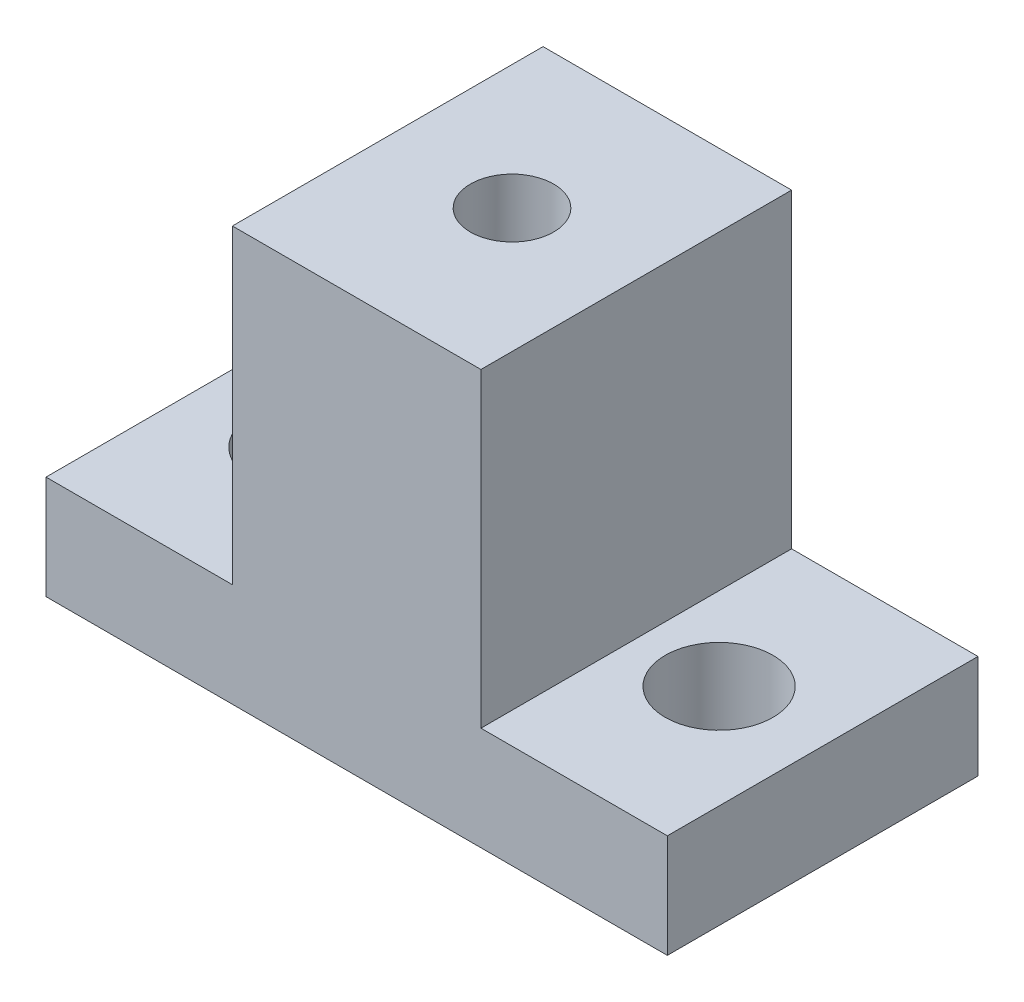
ISO-10303-21;
HEADER;
FILE_DESCRIPTION(('STEP AP214'),'2;1');
FILE_NAME('part.step','',(''),(''),'','','');
FILE_SCHEMA(('AUTOMOTIVE_DESIGN { 1 0 10303 214 1 1 1 1 }'));
ENDSEC;
DATA;
#1=APPLICATION_CONTEXT('core data for automotive mechanical design processes');
#2=APPLICATION_PROTOCOL_DEFINITION('international standard','automotive_design',2000,#1);
#3=PRODUCT_CONTEXT('',#1,'mechanical');
#4=PRODUCT('Part','Part','',(#3));
#5=PRODUCT_RELATED_PRODUCT_CATEGORY('part','',(#4));
#6=PRODUCT_DEFINITION_FORMATION('','',#4);
#7=PRODUCT_DEFINITION_CONTEXT('part definition',#1,'design');
#8=PRODUCT_DEFINITION('design','',#6,#7);
#9=PRODUCT_DEFINITION_SHAPE('','',#8);
#10=(LENGTH_UNIT() NAMED_UNIT(*) SI_UNIT(.MILLI.,.METRE.));
#11=(NAMED_UNIT(*) PLANE_ANGLE_UNIT() SI_UNIT($,.RADIAN.));
#12=(NAMED_UNIT(*) SI_UNIT($,.STERADIAN.) SOLID_ANGLE_UNIT());
#13=UNCERTAINTY_MEASURE_WITH_UNIT(LENGTH_MEASURE(1.E-05),#10,'distance_accuracy_value','');
#14=(GEOMETRIC_REPRESENTATION_CONTEXT(3) GLOBAL_UNCERTAINTY_ASSIGNED_CONTEXT((#13)) GLOBAL_UNIT_ASSIGNED_CONTEXT((#10,
#11,#12)) REPRESENTATION_CONTEXT('',''));
#15=CARTESIAN_POINT('',(0.,0.,0.));
#16=DIRECTION('',(0.,0.,1.));
#17=DIRECTION('',(1.,0.,0.));
#18=AXIS2_PLACEMENT_3D('',#15,#16,#17);
#19=CARTESIAN_POINT('',(0.,-12.7,0.));
#20=DIRECTION('',(0.,1.,0.));
#21=DIRECTION('',(0.,0.,1.));
#22=AXIS2_PLACEMENT_3D('',#19,#20,#21);
#23=PLANE('',#22);
#24=CARTESIAN_POINT('',(0.,-12.7,0.));
#25=DIRECTION('',(0.,-1.,0.));
#26=DIRECTION('',(0.,0.,-1.));
#27=AXIS2_PLACEMENT_3D('',#24,#25,#26);
#28=CIRCLE('',#27,6.35);
#29=CARTESIAN_POINT('',(0.,-12.7,-6.35));
#30=VERTEX_POINT('',#29);
#31=EDGE_CURVE('E328',#30,#30,#28,.T.);
#32=ORIENTED_EDGE('',*,*,#31,.F.);
#33=EDGE_LOOP('',(#32));
#34=FACE_BOUND('',#33,.T.);
#35=DIRECTION('',(0.,0.,1.));
#36=VECTOR('',#35,1.);
#37=CARTESIAN_POINT('',(-19.05,-12.7,-9.525));
#38=LINE('',#37,#36);
#39=CARTESIAN_POINT('',(-19.05,-12.7,-9.525));
#40=VERTEX_POINT('',#39);
#41=CARTESIAN_POINT('',(-19.05,-12.7,9.525));
#42=VERTEX_POINT('',#41);
#43=EDGE_CURVE('E149',#40,#42,#38,.T.);
#44=ORIENTED_EDGE('',*,*,#43,.F.);
#45=DIRECTION('',(-1.,0.,0.));
#46=VECTOR('',#45,1.);
#47=CARTESIAN_POINT('',(-19.05,-12.7,-9.525));
#48=LINE('',#47,#46);
#49=CARTESIAN_POINT('',(19.05,-12.7,-9.525));
#50=VERTEX_POINT('',#49);
#51=EDGE_CURVE('E156',#50,#40,#48,.T.);
#52=ORIENTED_EDGE('',*,*,#51,.F.);
#53=DIRECTION('',(0.,0.,-1.));
#54=VECTOR('',#53,1.);
#55=CARTESIAN_POINT('',(19.05,-12.7,-9.525));
#56=LINE('',#55,#54);
#57=CARTESIAN_POINT('',(19.05,-12.7,9.525));
#58=VERTEX_POINT('',#57);
#59=EDGE_CURVE('E164',#58,#50,#56,.T.);
#60=ORIENTED_EDGE('',*,*,#59,.F.);
#61=DIRECTION('',(1.,0.,0.));
#62=VECTOR('',#61,1.);
#63=CARTESIAN_POINT('',(-19.05,-12.7,9.525));
#64=LINE('',#63,#62);
#65=EDGE_CURVE('E161',#42,#58,#64,.T.);
#66=ORIENTED_EDGE('',*,*,#65,.F.);
#67=EDGE_LOOP('',(#44,#52,#60,#66));
#68=FACE_BOUND('',#67,.T.);
#69=CARTESIAN_POINT('',(-12.7,-12.7,0.));
#70=DIRECTION('',(0.,1.,0.));
#71=DIRECTION('',(0.,0.,1.));
#72=AXIS2_PLACEMENT_3D('',#69,#70,#71);
#73=CIRCLE('',#72,3.302);
#74=CARTESIAN_POINT('',(-12.7,-12.7,3.302));
#75=VERTEX_POINT('',#74);
#76=EDGE_CURVE('E132',#75,#75,#73,.T.);
#77=ORIENTED_EDGE('',*,*,#76,.T.);
#78=EDGE_LOOP('',(#77));
#79=FACE_BOUND('',#78,.T.);
#80=CARTESIAN_POINT('',(12.7,-12.7,0.));
#81=DIRECTION('',(0.,-1.,0.));
#82=DIRECTION('',(0.,0.,1.));
#83=AXIS2_PLACEMENT_3D('',#80,#81,#82);
#84=CIRCLE('',#83,3.302);
#85=CARTESIAN_POINT('',(12.7,-12.7,3.302));
#86=VERTEX_POINT('',#85);
#87=EDGE_CURVE('E127',#86,#86,#84,.T.);
#88=ORIENTED_EDGE('',*,*,#87,.F.);
#89=EDGE_LOOP('',(#88));
#90=FACE_BOUND('',#89,.T.);
#91=ADVANCED_FACE('F34',(#34,#68,#79,#90),#23,.F.);
#92=CARTESIAN_POINT('',(19.05,-6.35,-9.525));
#93=DIRECTION('',(0.,1.,0.));
#94=DIRECTION('',(-1.,0.,0.));
#95=AXIS2_PLACEMENT_3D('',#92,#93,#94);
#96=PLANE('',#95);
#97=DIRECTION('',(-1.,0.,0.));
#98=VECTOR('',#97,1.);
#99=CARTESIAN_POINT('',(19.05,-6.35,9.525));
#100=LINE('',#99,#98);
#101=CARTESIAN_POINT('',(19.05,-6.35,9.525));
#102=VERTEX_POINT('',#101);
#103=CARTESIAN_POINT('',(7.62,-6.35,9.525));
#104=VERTEX_POINT('',#103);
#105=EDGE_CURVE('E120',#102,#104,#100,.T.);
#106=ORIENTED_EDGE('',*,*,#105,.F.);
#107=DIRECTION('',(0.,0.,1.));
#108=VECTOR('',#107,1.);
#109=CARTESIAN_POINT('',(19.05,-6.35,-9.525));
#110=LINE('',#109,#108);
#111=CARTESIAN_POINT('',(19.05,-6.35,-9.525));
#112=VERTEX_POINT('',#111);
#113=EDGE_CURVE('E106',#112,#102,#110,.T.);
#114=ORIENTED_EDGE('',*,*,#113,.F.);
#115=DIRECTION('',(-1.,0.,0.));
#116=VECTOR('',#115,1.);
#117=CARTESIAN_POINT('',(19.05,-6.35,-9.525));
#118=LINE('',#117,#116);
#119=CARTESIAN_POINT('',(7.62,-6.35,-9.525));
#120=VERTEX_POINT('',#119);
#121=EDGE_CURVE('E100',#112,#120,#118,.T.);
#122=ORIENTED_EDGE('',*,*,#121,.T.);
#123=DIRECTION('',(0.,0.,1.));
#124=VECTOR('',#123,1.);
#125=CARTESIAN_POINT('',(7.62,-6.35,-9.525));
#126=LINE('',#125,#124);
#127=EDGE_CURVE('E103',#120,#104,#126,.T.);
#128=ORIENTED_EDGE('',*,*,#127,.T.);
#129=EDGE_LOOP('',(#106,#114,#122,#128));
#130=FACE_BOUND('',#129,.T.);
#131=CARTESIAN_POINT('',(12.7,-6.35,0.));
#132=DIRECTION('',(0.,-1.,0.));
#133=DIRECTION('',(0.,0.,1.));
#134=AXIS2_PLACEMENT_3D('',#131,#132,#133);
#135=CIRCLE('',#134,3.302);
#136=CARTESIAN_POINT('',(12.7,-6.35,3.302));
#137=VERTEX_POINT('',#136);
#138=EDGE_CURVE('E124',#137,#137,#135,.T.);
#139=ORIENTED_EDGE('',*,*,#138,.T.);
#140=EDGE_LOOP('',(#139));
#141=FACE_BOUND('',#140,.T.);
#142=ADVANCED_FACE('F101',(#130,#141),#96,.T.);
#143=CARTESIAN_POINT('',(-19.05,12.7,9.525));
#144=DIRECTION('',(0.,0.,-1.));
#145=DIRECTION('',(-1.,0.,0.));
#146=AXIS2_PLACEMENT_3D('',#143,#144,#145);
#147=PLANE('',#146);
#148=ORIENTED_EDGE('',*,*,#105,.T.);
#149=DIRECTION('',(0.,1.,0.));
#150=VECTOR('',#149,1.);
#151=CARTESIAN_POINT('',(7.62,12.7,9.525));
#152=LINE('',#151,#150);
#153=CARTESIAN_POINT('',(7.62,12.7,9.525));
#154=VERTEX_POINT('',#153);
#155=EDGE_CURVE('E113',#104,#154,#152,.T.);
#156=ORIENTED_EDGE('',*,*,#155,.T.);
#157=DIRECTION('',(1.,0.,0.));
#158=VECTOR('',#157,1.);
#159=CARTESIAN_POINT('',(-19.05,12.7,9.525));
#160=LINE('',#159,#158);
#161=CARTESIAN_POINT('',(-7.61999999999999,12.7,9.525));
#162=VERTEX_POINT('',#161);
#163=EDGE_CURVE('E153',#162,#154,#160,.T.);
#164=ORIENTED_EDGE('',*,*,#163,.F.);
#165=DIRECTION('',(0.,1.,0.));
#166=VECTOR('',#165,1.);
#167=CARTESIAN_POINT('',(-7.62,12.7,9.525));
#168=LINE('',#167,#166);
#169=CARTESIAN_POINT('',(-7.62,-6.35,9.525));
#170=VERTEX_POINT('',#169);
#171=EDGE_CURVE('E58',#170,#162,#168,.T.);
#172=ORIENTED_EDGE('',*,*,#171,.F.);
#173=DIRECTION('',(1.,0.,0.));
#174=VECTOR('',#173,1.);
#175=CARTESIAN_POINT('',(-19.05,-6.35,9.525));
#176=LINE('',#175,#174);
#177=CARTESIAN_POINT('',(-19.05,-6.35,9.525));
#178=VERTEX_POINT('',#177);
#179=EDGE_CURVE('E135',#178,#170,#176,.T.);
#180=ORIENTED_EDGE('',*,*,#179,.F.);
#181=DIRECTION('',(0.,-1.,0.));
#182=VECTOR('',#181,1.);
#183=CARTESIAN_POINT('',(-19.05,12.7,9.525));
#184=LINE('',#183,#182);
#185=EDGE_CURVE('E11',#178,#42,#184,.T.);
#186=ORIENTED_EDGE('',*,*,#185,.T.);
#187=ORIENTED_EDGE('',*,*,#65,.T.);
#188=DIRECTION('',(0.,-1.,0.));
#189=VECTOR('',#188,1.);
#190=CARTESIAN_POINT('',(19.05,12.7,9.525));
#191=LINE('',#190,#189);
#192=EDGE_CURVE('E43',#102,#58,#191,.T.);
#193=ORIENTED_EDGE('',*,*,#192,.F.);
#194=EDGE_LOOP('',(#148,#156,#164,#172,#180,#186,#187,#193));
#195=FACE_BOUND('',#194,.T.);
#196=ADVANCED_FACE('F179',(#195),#147,.F.);
#197=CARTESIAN_POINT('',(19.05,12.7,-9.525));
#198=DIRECTION('',(-1.,0.,0.));
#199=DIRECTION('',(0.,0.,1.));
#200=AXIS2_PLACEMENT_3D('',#197,#198,#199);
#201=PLANE('',#200);
#202=ORIENTED_EDGE('',*,*,#113,.T.);
#203=ORIENTED_EDGE('',*,*,#192,.T.);
#204=ORIENTED_EDGE('',*,*,#59,.T.);
#205=DIRECTION('',(0.,-1.,0.));
#206=VECTOR('',#205,1.);
#207=CARTESIAN_POINT('',(19.05,12.7,-9.525));
#208=LINE('',#207,#206);
#209=EDGE_CURVE('E170',#112,#50,#208,.T.);
#210=ORIENTED_EDGE('',*,*,#209,.F.);
#211=EDGE_LOOP('',(#202,#203,#204,#210));
#212=FACE_BOUND('',#211,.T.);
#213=ADVANCED_FACE('F174',(#212),#201,.F.);
#214=CARTESIAN_POINT('',(-19.05,12.7,-9.525));
#215=DIRECTION('',(0.,0.,1.));
#216=DIRECTION('',(1.,0.,0.));
#217=AXIS2_PLACEMENT_3D('',#214,#215,#216);
#218=PLANE('',#217);
#219=ORIENTED_EDGE('',*,*,#121,.F.);
#220=ORIENTED_EDGE('',*,*,#209,.T.);
#221=ORIENTED_EDGE('',*,*,#51,.T.);
#222=DIRECTION('',(0.,-1.,0.));
#223=VECTOR('',#222,1.);
#224=CARTESIAN_POINT('',(-19.05,12.7,-9.525));
#225=LINE('',#224,#223);
#226=CARTESIAN_POINT('',(-19.05,-6.35,-9.525));
#227=VERTEX_POINT('',#226);
#228=EDGE_CURVE('E158',#227,#40,#225,.T.);
#229=ORIENTED_EDGE('',*,*,#228,.F.);
#230=DIRECTION('',(1.,0.,0.));
#231=VECTOR('',#230,1.);
#232=CARTESIAN_POINT('',(-19.05,-6.35,-9.525));
#233=LINE('',#232,#231);
#234=CARTESIAN_POINT('',(-7.62,-6.35,-9.525));
#235=VERTEX_POINT('',#234);
#236=EDGE_CURVE('E138',#227,#235,#233,.T.);
#237=ORIENTED_EDGE('',*,*,#236,.T.);
#238=DIRECTION('',(0.,1.,0.));
#239=VECTOR('',#238,1.);
#240=CARTESIAN_POINT('',(-7.62,12.7,-9.525));
#241=LINE('',#240,#239);
#242=CARTESIAN_POINT('',(-7.62,12.7,-9.525));
#243=VERTEX_POINT('',#242);
#244=EDGE_CURVE('E141',#235,#243,#241,.T.);
#245=ORIENTED_EDGE('',*,*,#244,.T.);
#246=DIRECTION('',(-1.,0.,0.));
#247=VECTOR('',#246,1.);
#248=CARTESIAN_POINT('',(-19.05,12.7,-9.525));
#249=LINE('',#248,#247);
#250=CARTESIAN_POINT('',(7.61999999999999,12.7,-9.525));
#251=VERTEX_POINT('',#250);
#252=EDGE_CURVE('E119',#251,#243,#249,.T.);
#253=ORIENTED_EDGE('',*,*,#252,.F.);
#254=DIRECTION('',(0.,1.,0.));
#255=VECTOR('',#254,1.);
#256=CARTESIAN_POINT('',(7.62,12.7,-9.525));
#257=LINE('',#256,#255);
#258=EDGE_CURVE('E50',#120,#251,#257,.T.);
#259=ORIENTED_EDGE('',*,*,#258,.F.);
#260=EDGE_LOOP('',(#219,#220,#221,#229,#237,#245,#253,#259));
#261=FACE_BOUND('',#260,.T.);
#262=ADVANCED_FACE('F117',(#261),#218,.F.);
#263=CARTESIAN_POINT('',(0.,12.7,0.));
#264=DIRECTION('',(0.,1.,0.));
#265=DIRECTION('',(0.,0.,1.));
#266=AXIS2_PLACEMENT_3D('',#263,#264,#265);
#267=PLANE('',#266);
#268=CARTESIAN_POINT('',(0.,12.7,0.));
#269=DIRECTION('',(0.,1.,0.));
#270=DIRECTION('',(0.,0.,1.));
#271=AXIS2_PLACEMENT_3D('',#268,#269,#270);
#272=CIRCLE('',#271,2.55269999999999);
#273=CARTESIAN_POINT('',(0.,12.7,2.55269999999999));
#274=VERTEX_POINT('',#273);
#275=EDGE_CURVE('E326',#274,#274,#272,.T.);
#276=ORIENTED_EDGE('',*,*,#275,.F.);
#277=EDGE_LOOP('',(#276));
#278=FACE_BOUND('',#277,.T.);
#279=ORIENTED_EDGE('',*,*,#163,.T.);
#280=DIRECTION('',(0.,0.,1.));
#281=VECTOR('',#280,1.);
#282=CARTESIAN_POINT('',(7.62,12.7,-9.525));
#283=LINE('',#282,#281);
#284=EDGE_CURVE('E109',#251,#154,#283,.T.);
#285=ORIENTED_EDGE('',*,*,#284,.F.);
#286=ORIENTED_EDGE('',*,*,#252,.T.);
#287=DIRECTION('',(0.,0.,1.));
#288=VECTOR('',#287,1.);
#289=CARTESIAN_POINT('',(-7.62,12.7,-9.525));
#290=LINE('',#289,#288);
#291=EDGE_CURVE('E147',#243,#162,#290,.T.);
#292=ORIENTED_EDGE('',*,*,#291,.T.);
#293=EDGE_LOOP('',(#279,#285,#286,#292));
#294=FACE_BOUND('',#293,.T.);
#295=ADVANCED_FACE('F192',(#278,#294),#267,.T.);
#296=CARTESIAN_POINT('',(-19.05,12.7,-9.525));
#297=DIRECTION('',(1.,0.,0.));
#298=DIRECTION('',(0.,0.,-1.));
#299=AXIS2_PLACEMENT_3D('',#296,#297,#298);
#300=PLANE('',#299);
#301=ORIENTED_EDGE('',*,*,#185,.F.);
#302=DIRECTION('',(0.,0.,1.));
#303=VECTOR('',#302,1.);
#304=CARTESIAN_POINT('',(-19.05,-6.35,-9.525));
#305=LINE('',#304,#303);
#306=EDGE_CURVE('E143',#227,#178,#305,.T.);
#307=ORIENTED_EDGE('',*,*,#306,.F.);
#308=ORIENTED_EDGE('',*,*,#228,.T.);
#309=ORIENTED_EDGE('',*,*,#43,.T.);
#310=EDGE_LOOP('',(#301,#307,#308,#309));
#311=FACE_BOUND('',#310,.T.);
#312=ADVANCED_FACE('F36',(#311),#300,.F.);
#313=CARTESIAN_POINT('',(-7.62,12.7,-9.525));
#314=DIRECTION('',(1.,0.,0.));
#315=DIRECTION('',(0.,1.,0.));
#316=AXIS2_PLACEMENT_3D('',#313,#314,#315);
#317=PLANE('',#316);
#318=ORIENTED_EDGE('',*,*,#171,.T.);
#319=ORIENTED_EDGE('',*,*,#291,.F.);
#320=ORIENTED_EDGE('',*,*,#244,.F.);
#321=DIRECTION('',(0.,0.,1.));
#322=VECTOR('',#321,1.);
#323=CARTESIAN_POINT('',(-7.62,-6.35,-9.525));
#324=LINE('',#323,#322);
#325=EDGE_CURVE('E150',#235,#170,#324,.T.);
#326=ORIENTED_EDGE('',*,*,#325,.T.);
#327=EDGE_LOOP('',(#318,#319,#320,#326));
#328=FACE_BOUND('',#327,.T.);
#329=ADVANCED_FACE('F194',(#328),#317,.F.);
#330=CARTESIAN_POINT('',(-19.05,-6.35,-9.525));
#331=DIRECTION('',(0.,-1.,0.));
#332=DIRECTION('',(1.,0.,0.));
#333=AXIS2_PLACEMENT_3D('',#330,#331,#332);
#334=PLANE('',#333);
#335=CARTESIAN_POINT('',(-12.7,-6.35,0.));
#336=DIRECTION('',(0.,1.,0.));
#337=DIRECTION('',(0.,0.,1.));
#338=AXIS2_PLACEMENT_3D('',#335,#336,#337);
#339=CIRCLE('',#338,3.302);
#340=CARTESIAN_POINT('',(-12.7,-6.35,3.302));
#341=VERTEX_POINT('',#340);
#342=EDGE_CURVE('E129',#341,#341,#339,.T.);
#343=ORIENTED_EDGE('',*,*,#342,.F.);
#344=EDGE_LOOP('',(#343));
#345=FACE_BOUND('',#344,.T.);
#346=ORIENTED_EDGE('',*,*,#179,.T.);
#347=ORIENTED_EDGE('',*,*,#325,.F.);
#348=ORIENTED_EDGE('',*,*,#236,.F.);
#349=ORIENTED_EDGE('',*,*,#306,.T.);
#350=EDGE_LOOP('',(#346,#347,#348,#349));
#351=FACE_BOUND('',#350,.T.);
#352=ADVANCED_FACE('F189',(#345,#351),#334,.F.);
#353=CARTESIAN_POINT('',(-12.7,-12.7,0.));
#354=DIRECTION('',(0.,1.,0.));
#355=DIRECTION('',(0.,0.,1.));
#356=AXIS2_PLACEMENT_3D('',#353,#354,#355);
#357=CYLINDRICAL_SURFACE('',#356,3.302);
#358=ORIENTED_EDGE('',*,*,#76,.F.);
#359=EDGE_LOOP('',(#358));
#360=FACE_BOUND('',#359,.T.);
#361=ORIENTED_EDGE('',*,*,#342,.T.);
#362=EDGE_LOOP('',(#361));
#363=FACE_BOUND('',#362,.T.);
#364=ADVANCED_FACE('F201',(#360,#363),#357,.F.);
#365=CARTESIAN_POINT('',(7.62,12.7,-9.525));
#366=DIRECTION('',(1.,0.,0.));
#367=DIRECTION('',(0.,1.,0.));
#368=AXIS2_PLACEMENT_3D('',#365,#366,#367);
#369=PLANE('',#368);
#370=ORIENTED_EDGE('',*,*,#155,.F.);
#371=ORIENTED_EDGE('',*,*,#127,.F.);
#372=ORIENTED_EDGE('',*,*,#258,.T.);
#373=ORIENTED_EDGE('',*,*,#284,.T.);
#374=EDGE_LOOP('',(#370,#371,#372,#373));
#375=FACE_BOUND('',#374,.T.);
#376=ADVANCED_FACE('F111',(#375),#369,.T.);
#377=CARTESIAN_POINT('',(12.7,-12.7,0.));
#378=DIRECTION('',(0.,1.,0.));
#379=DIRECTION('',(0.,0.,1.));
#380=AXIS2_PLACEMENT_3D('',#377,#378,#379);
#381=CYLINDRICAL_SURFACE('',#380,3.302);
#382=ORIENTED_EDGE('',*,*,#87,.T.);
#383=EDGE_LOOP('',(#382));
#384=FACE_BOUND('',#383,.T.);
#385=ORIENTED_EDGE('',*,*,#138,.F.);
#386=EDGE_LOOP('',(#385));
#387=FACE_BOUND('',#386,.T.);
#388=ADVANCED_FACE('F280',(#384,#387),#381,.F.);
#389=CARTESIAN_POINT('',(0.,6.35,0.));
#390=DIRECTION('',(0.,-1.,0.));
#391=DIRECTION('',(0.,0.,-1.));
#392=AXIS2_PLACEMENT_3D('',#389,#390,#391);
#393=CYLINDRICAL_SURFACE('',#392,6.35);
#394=CARTESIAN_POINT('',(0.,6.35,0.));
#395=DIRECTION('',(0.,-1.,0.));
#396=DIRECTION('',(0.,0.,-1.));
#397=AXIS2_PLACEMENT_3D('',#394,#395,#396);
#398=CIRCLE('',#397,6.35);
#399=CARTESIAN_POINT('',(0.,6.35,-6.35));
#400=VERTEX_POINT('',#399);
#401=EDGE_CURVE('E330',#400,#400,#398,.T.);
#402=ORIENTED_EDGE('',*,*,#401,.F.);
#403=EDGE_LOOP('',(#402));
#404=FACE_BOUND('',#403,.T.);
#405=ORIENTED_EDGE('',*,*,#31,.T.);
#406=EDGE_LOOP('',(#405));
#407=FACE_BOUND('',#406,.T.);
#408=ADVANCED_FACE('F285',(#404,#407),#393,.F.);
#409=CARTESIAN_POINT('',(0.,6.35,0.));
#410=DIRECTION('',(0.,-1.,0.));
#411=DIRECTION('',(0.,0.,-1.));
#412=AXIS2_PLACEMENT_3D('',#409,#410,#411);
#413=PLANE('',#412);
#414=CARTESIAN_POINT('',(0.,6.35,0.));
#415=DIRECTION('',(0.,-1.,0.));
#416=DIRECTION('',(0.,0.,-1.));
#417=AXIS2_PLACEMENT_3D('',#414,#415,#416);
#418=CIRCLE('',#417,2.55269999999999);
#419=CARTESIAN_POINT('',(0.,6.35,-2.55269999999999));
#420=VERTEX_POINT('',#419);
#421=EDGE_CURVE('E38',#420,#420,#418,.T.);
#422=ORIENTED_EDGE('',*,*,#421,.F.);
#423=EDGE_LOOP('',(#422));
#424=FACE_BOUND('',#423,.T.);
#425=ORIENTED_EDGE('',*,*,#401,.T.);
#426=EDGE_LOOP('',(#425));
#427=FACE_BOUND('',#426,.T.);
#428=ADVANCED_FACE('F293',(#424,#427),#413,.T.);
#429=CARTESIAN_POINT('',(0.,12.7,0.));
#430=DIRECTION('',(0.,1.,0.));
#431=DIRECTION('',(0.,0.,1.));
#432=AXIS2_PLACEMENT_3D('',#429,#430,#431);
#433=CYLINDRICAL_SURFACE('',#432,2.55269999999999);
#434=ORIENTED_EDGE('',*,*,#421,.T.);
#435=EDGE_LOOP('',(#434));
#436=FACE_BOUND('',#435,.T.);
#437=ORIENTED_EDGE('',*,*,#275,.T.);
#438=EDGE_LOOP('',(#437));
#439=FACE_BOUND('',#438,.T.);
#440=ADVANCED_FACE('F301',(#436,#439),#433,.F.);
#441=CLOSED_SHELL('',(#91,#142,#196,#213,#262,#295,#312,#329,#352,#364,#376,#388,#408,#428,#440));
#442=MANIFOLD_SOLID_BREP('B2',#441);
#443=ADVANCED_BREP_SHAPE_REPRESENTATION('',(#18,#442),#14);
#444=SHAPE_DEFINITION_REPRESENTATION(#9,#443);
ENDSEC;
END-ISO-10303-21;
